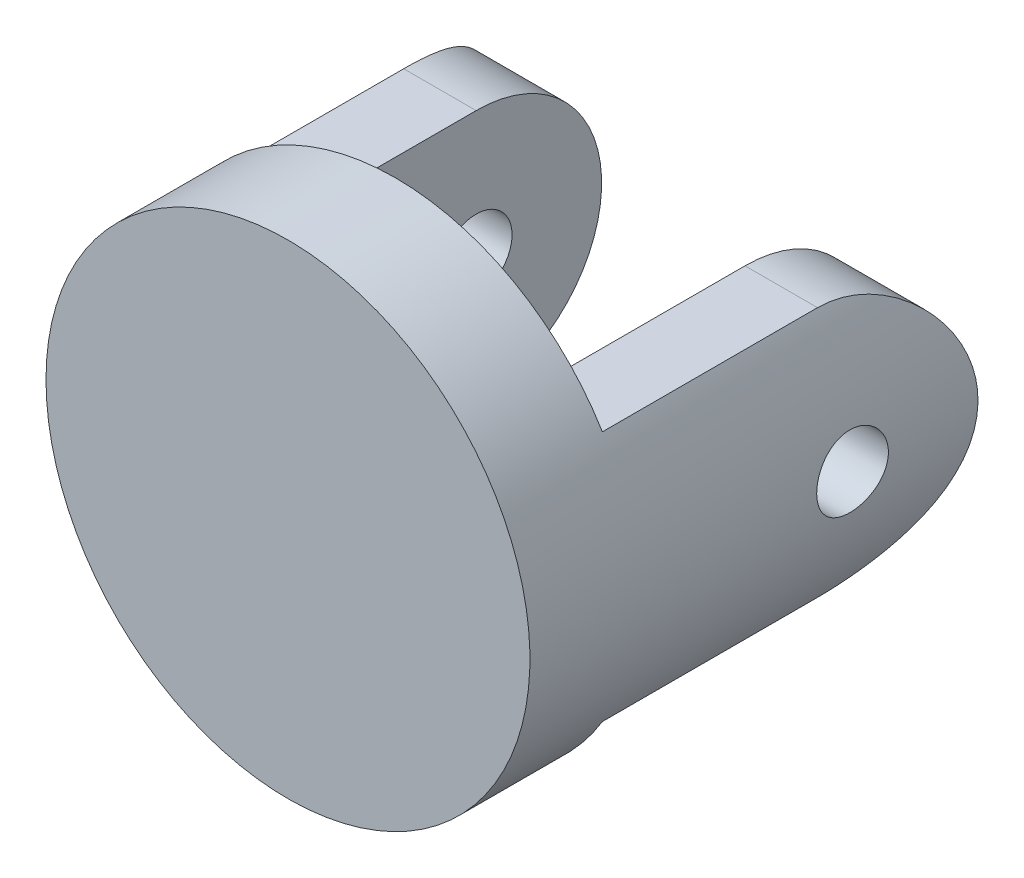
ISO-10303-21;
HEADER;
FILE_DESCRIPTION(('STEP AP214'),'2;1');
FILE_NAME('part.step','',(''),(''),'','','');
FILE_SCHEMA(('AUTOMOTIVE_DESIGN { 1 0 10303 214 1 1 1 1 }'));
ENDSEC;
DATA;
#1=APPLICATION_CONTEXT('core data for automotive mechanical design processes');
#2=APPLICATION_PROTOCOL_DEFINITION('international standard','automotive_design',2000,#1);
#3=PRODUCT_CONTEXT('',#1,'mechanical');
#4=PRODUCT('Part','Part','',(#3));
#5=PRODUCT_RELATED_PRODUCT_CATEGORY('part','',(#4));
#6=PRODUCT_DEFINITION_FORMATION('','',#4);
#7=PRODUCT_DEFINITION_CONTEXT('part definition',#1,'design');
#8=PRODUCT_DEFINITION('design','',#6,#7);
#9=PRODUCT_DEFINITION_SHAPE('','',#8);
#10=(LENGTH_UNIT() NAMED_UNIT(*) SI_UNIT(.MILLI.,.METRE.));
#11=(NAMED_UNIT(*) PLANE_ANGLE_UNIT() SI_UNIT($,.RADIAN.));
#12=(NAMED_UNIT(*) SI_UNIT($,.STERADIAN.) SOLID_ANGLE_UNIT());
#13=UNCERTAINTY_MEASURE_WITH_UNIT(LENGTH_MEASURE(1.E-05),#10,'distance_accuracy_value','');
#14=(GEOMETRIC_REPRESENTATION_CONTEXT(3) GLOBAL_UNCERTAINTY_ASSIGNED_CONTEXT((#13)) GLOBAL_UNIT_ASSIGNED_CONTEXT((#10,
#11,#12)) REPRESENTATION_CONTEXT('',''));
#15=CARTESIAN_POINT('',(0.,0.,0.));
#16=DIRECTION('',(0.,0.,1.));
#17=DIRECTION('',(1.,0.,0.));
#18=AXIS2_PLACEMENT_3D('',#15,#16,#17);
#19=CARTESIAN_POINT('',(0.,0.,-3.));
#20=DIRECTION('',(0.,0.,1.));
#21=DIRECTION('',(1.,0.,0.));
#22=AXIS2_PLACEMENT_3D('',#19,#20,#21);
#23=CYLINDRICAL_SURFACE('',#22,6.75);
#24=CARTESIAN_POINT('',(-6.75,0.,-10.));
#25=CARTESIAN_POINT('',(-6.74999911272059,0.0558425409101663,-9.99999769097387));
#26=CARTESIAN_POINT('',(-6.74929975767196,0.11171768484445,-9.99530662620021));
#27=CARTESIAN_POINT('',(-6.74657719642042,0.221906738606192,-9.97667074513461));
#28=CARTESIAN_POINT('',(-6.74455269374564,0.276219065053059,-9.96271686628341));
#29=CARTESIAN_POINT('',(-6.73940739080019,0.381671836837066,-9.92598098260033));
#30=CARTESIAN_POINT('',(-6.73628741208205,0.432814625447512,-9.90320559214683));
#31=CARTESIAN_POINT('',(-6.72929609307386,0.530544531243025,-9.84948922871422));
#32=CARTESIAN_POINT('',(-6.72542485910577,0.577132291680523,-9.81854941098927));
#33=CARTESIAN_POINT('',(-6.71732864075089,0.664793017751611,-9.7491309350935));
#34=CARTESIAN_POINT('',(-6.71310142384377,0.705826205517573,-9.7106023010483));
#35=CARTESIAN_POINT('',(-6.70478718892022,0.780869855713782,-9.62720740946487));
#36=CARTESIAN_POINT('',(-6.70070017890102,0.81487991810721,-9.58234079116041));
#37=CARTESIAN_POINT('',(-6.69310742202681,0.875066235908764,-9.48727692835771));
#38=CARTESIAN_POINT('',(-6.6896045599627,0.901204098047282,-9.43705512613478));
#39=CARTESIAN_POINT('',(-6.68360711396162,0.944658716040232,-9.33287374825251));
#40=CARTESIAN_POINT('',(-6.68111247643255,0.961975940767681,-9.27891437144231));
#41=CARTESIAN_POINT('',(-6.67743583632494,0.987174376659307,-9.16920749903019));
#42=CARTESIAN_POINT('',(-6.67624437438597,0.995123620308465,-9.11347595250868));
#43=CARTESIAN_POINT('',(-6.67528025275461,1.0015711832689,-9.00145820866673));
#44=CARTESIAN_POINT('',(-6.67550751356993,1.00007003209414,-8.94517204259854));
#45=CARTESIAN_POINT('',(-6.67734650914669,0.98771503469444,-8.83412288677399));
#46=CARTESIAN_POINT('',(-6.67894703709383,0.976936892914969,-8.77935126207585));
#47=CARTESIAN_POINT('',(-6.68333472365175,0.946452342629808,-8.67240258097881));
#48=CARTESIAN_POINT('',(-6.68612191507621,0.926745687231396,-8.62022559637161));
#49=CARTESIAN_POINT('',(-6.69258128775432,0.878884561850785,-8.51971658561811));
#50=CARTESIAN_POINT('',(-6.69625682457254,0.850697959155643,-8.47140008514764));
#51=CARTESIAN_POINT('',(-6.70407630948204,0.786699945498341,-8.38015396406128));
#52=CARTESIAN_POINT('',(-6.70822028756469,0.750888046206287,-8.33722468872742));
#53=CARTESIAN_POINT('',(-6.71655927335414,0.672240133725876,-8.2575328147743));
#54=CARTESIAN_POINT('',(-6.7207543845646,0.629339018930789,-8.22083444531941));
#55=CARTESIAN_POINT('',(-6.72868539581363,0.53795254497229,-8.15514880450797));
#56=CARTESIAN_POINT('',(-6.73242129392949,0.489467162429428,-8.12616156543701));
#57=CARTESIAN_POINT('',(-6.73901671048289,0.388233293631781,-8.07671798502691));
#58=CARTESIAN_POINT('',(-6.74187572726903,0.335482388854872,-8.05626652448112));
#59=CARTESIAN_POINT('',(-6.74639102909035,0.227243041616981,-8.02453049251672));
#60=CARTESIAN_POINT('',(-6.74804739342113,0.171754779898363,-8.01324531672315));
#61=CARTESIAN_POINT('',(-6.74996027662796,0.0601702510974134,-8.00024743323401));
#62=CARTESIAN_POINT('',(-6.75022971002842,0.00408448467763339,-7.99844640941821));
#63=CARTESIAN_POINT('',(-6.74937350522533,-0.107588256207567,-8.0042336439311));
#64=CARTESIAN_POINT('',(-6.74824790911938,-0.163175245673516,-8.01182161892944));
#65=CARTESIAN_POINT('',(-6.74473610882736,-0.272005564748215,-8.03609802204365));
#66=CARTESIAN_POINT('',(-6.74235585630278,-0.32525868441956,-8.05274349642072));
#67=CARTESIAN_POINT('',(-6.736600801366,-0.428218204093146,-8.09461714889859));
#68=CARTESIAN_POINT('',(-6.73322595324427,-0.47792444095768,-8.11984572146875));
#69=CARTESIAN_POINT('',(-6.72582473545489,-0.572768052310923,-8.17837713660647));
#70=CARTESIAN_POINT('',(-6.72179390576589,-0.617870444216265,-8.21173609025629));
#71=CARTESIAN_POINT('',(-6.71354345616816,-0.70186815594721,-8.28550310799369));
#72=CARTESIAN_POINT('',(-6.70932382558081,-0.740763124109861,-8.32591157117883));
#73=CARTESIAN_POINT('',(-6.70113048938946,-0.811562616638169,-8.41302340493409));
#74=CARTESIAN_POINT('',(-6.69715905164284,-0.843407990393644,-8.45977509537694));
#75=CARTESIAN_POINT('',(-6.68995170503097,-0.898793373321401,-8.55801596133042));
#76=CARTESIAN_POINT('',(-6.68671577667948,-0.922333602535497,-8.60950501128083));
#77=CARTESIAN_POINT('',(-6.68136217784517,-0.960348470530136,-8.71558147446953));
#78=CARTESIAN_POINT('',(-6.67924064990097,-0.974854414016819,-8.77015746572115));
#79=CARTESIAN_POINT('',(-6.67634573947977,-0.994488675177338,-8.88100475377632));
#80=CARTESIAN_POINT('',(-6.67557226638415,-0.999617623190394,-8.93727593636741));
#81=CARTESIAN_POINT('',(-6.67546436730878,-1.00033757943703,-9.04932679953471));
#82=CARTESIAN_POINT('',(-6.67611591022978,-0.996021584936614,-9.1051058913773));
#83=CARTESIAN_POINT('',(-6.67875416313144,-0.978173271070794,-9.21513569011213));
#84=CARTESIAN_POINT('',(-6.68074087117957,-0.964640965045213,-9.26938639921645));
#85=CARTESIAN_POINT('',(-6.6858207421393,-0.928776749344401,-9.37479475543769));
#86=CARTESIAN_POINT('',(-6.68891310765919,-0.906451180127705,-9.42595460065922));
#87=CARTESIAN_POINT('',(-6.69585685750153,-0.853643415012498,-9.52381748578127));
#88=CARTESIAN_POINT('',(-6.69970826624953,-0.823160956618996,-9.57052038218812));
#89=CARTESIAN_POINT('',(-6.70778131838235,-0.75456623134579,-9.65861638512301));
#90=CARTESIAN_POINT('',(-6.7120060970762,-0.716385046344521,-9.69995554821063));
#91=CARTESIAN_POINT('',(-6.72032356595988,-0.633622295064075,-9.77567319173752));
#92=CARTESIAN_POINT('',(-6.72441622518943,-0.589039241744765,-9.810050050473));
#93=CARTESIAN_POINT('',(-6.73203333976492,-0.49445748182144,-9.87103143181466));
#94=CARTESIAN_POINT('',(-6.73555463068598,-0.444431017911155,-9.89759329015296));
#95=CARTESIAN_POINT('',(-6.74160116950649,-0.340598638239509,-9.94189806599035));
#96=CARTESIAN_POINT('',(-6.74412745252673,-0.286796719176187,-9.9596501534456));
#97=CARTESIAN_POINT('',(-6.7473200627825,-0.193958660761499,-9.9817862974269));
#98=CARTESIAN_POINT('',(-6.74831989929762,-0.155496645397277,-9.98860604809085));
#99=CARTESIAN_POINT('',(-6.74966017396957,-0.0780283890929515,-9.99771367900938));
#100=CARTESIAN_POINT('',(-6.75000062002111,-0.0390221546742599,-10.0000016135221));
#101=CARTESIAN_POINT('',(-6.75,0.,-10.));
#102=B_SPLINE_CURVE_WITH_KNOTS('',3,(#24,#25,#26,#27,#28,#29,#30,#31,#32,#33,#34,#35,#36,#37,
#38,#39,#40,#41,#42,#43,#44,#45,#46,#47,#48,#49,#50,#51,#52,#53,#54,#55,#56,#57,#58,#59,#60,#61,
#62,#63,#64,#65,#66,#67,#68,#69,#70,#71,#72,#73,#74,#75,#76,#77,#78,#79,#80,#81,#82,#83,#84,#85,
#86,#87,#88,#89,#90,#91,#92,#93,#94,#95,#96,#97,#98,#99,#100,#101),.UNSPECIFIED.,.T.,.F.,(4,2,2,
2,2,2,2,2,2,2,2,2,2,2,2,2,2,2,2,2,2,2,2,2,2,2,2,2,2,2,2,2,2,2,2,2,2,2,4),(0.,0.167385036095002,
0.33493408033917,0.502357738579205,0.669757719315228,0.838299369512644,1.00685061718639,
1.17621106378314,1.34556250685453,1.51367634882374,1.68178077130973,1.84852625275946,
2.01527634536397,2.18266643054019,2.35006723873285,2.51910075696945,2.6881349829183,
2.85726573135219,3.02638532731912,3.19392726588316,3.36146414868354,3.52821335257178,
3.69497022109769,3.86291226368386,4.03086381714738,4.20017525181088,4.36948220029192,
4.53819917064466,4.70690479910917,4.87395678992067,5.04100853893917,5.20794005372038,
5.37487694113277,5.54338046523498,5.71192319321397,5.88136966036332,6.05063938138702,
6.16760760787006,6.28457443391695),.UNSPECIFIED.);
#103=CARTESIAN_POINT('',(-6.75,0.,-10.));
#104=VERTEX_POINT('',#103);
#105=EDGE_CURVE('E257',#104,#104,#102,.T.);
#106=ORIENTED_EDGE('',*,*,#105,.T.);
#107=EDGE_LOOP('',(#106));
#108=FACE_BOUND('',#107,.T.);
#109=CARTESIAN_POINT('',(6.75,0.,-10.));
#110=CARTESIAN_POINT('',(6.74999911272059,-0.0558425409101663,-9.99999769097387));
#111=CARTESIAN_POINT('',(6.74929975767196,-0.11171768484445,-9.99530662620021));
#112=CARTESIAN_POINT('',(6.74657719642042,-0.221906738606192,-9.97667074513461));
#113=CARTESIAN_POINT('',(6.74455269374564,-0.276219065053059,-9.96271686628341));
#114=CARTESIAN_POINT('',(6.73940739080019,-0.381671836837066,-9.92598098260033));
#115=CARTESIAN_POINT('',(6.73628741208205,-0.432814625447512,-9.90320559214683));
#116=CARTESIAN_POINT('',(6.72929609307386,-0.530544531243025,-9.84948922871422));
#117=CARTESIAN_POINT('',(6.72542485910577,-0.577132291680523,-9.81854941098927));
#118=CARTESIAN_POINT('',(6.71732864075089,-0.664793017751611,-9.7491309350935));
#119=CARTESIAN_POINT('',(6.71310142384377,-0.705826205517573,-9.7106023010483));
#120=CARTESIAN_POINT('',(6.70478718892022,-0.780869855713782,-9.62720740946487));
#121=CARTESIAN_POINT('',(6.70070017890102,-0.81487991810721,-9.58234079116041));
#122=CARTESIAN_POINT('',(6.69310742202681,-0.875066235908764,-9.48727692835771));
#123=CARTESIAN_POINT('',(6.6896045599627,-0.901204098047282,-9.43705512613478));
#124=CARTESIAN_POINT('',(6.68360711396162,-0.944658716040232,-9.33287374825251));
#125=CARTESIAN_POINT('',(6.68111247643255,-0.961975940767681,-9.27891437144231));
#126=CARTESIAN_POINT('',(6.67743583632494,-0.987174376659307,-9.16920749903019));
#127=CARTESIAN_POINT('',(6.67624437438597,-0.995123620308465,-9.11347595250868));
#128=CARTESIAN_POINT('',(6.67528025275461,-1.0015711832689,-9.00145820866673));
#129=CARTESIAN_POINT('',(6.67550751356993,-1.00007003209414,-8.94517204259854));
#130=CARTESIAN_POINT('',(6.67734650914669,-0.98771503469444,-8.83412288677399));
#131=CARTESIAN_POINT('',(6.67894703709383,-0.976936892914969,-8.77935126207585));
#132=CARTESIAN_POINT('',(6.68333472365175,-0.946452342629808,-8.67240258097881));
#133=CARTESIAN_POINT('',(6.68612191507621,-0.926745687231396,-8.62022559637161));
#134=CARTESIAN_POINT('',(6.69258128775432,-0.878884561850785,-8.51971658561811));
#135=CARTESIAN_POINT('',(6.69625682457254,-0.850697959155643,-8.47140008514764));
#136=CARTESIAN_POINT('',(6.70407630948204,-0.786699945498341,-8.38015396406128));
#137=CARTESIAN_POINT('',(6.70822028756469,-0.750888046206287,-8.33722468872742));
#138=CARTESIAN_POINT('',(6.71655927335414,-0.672240133725876,-8.2575328147743));
#139=CARTESIAN_POINT('',(6.7207543845646,-0.629339018930789,-8.22083444531941));
#140=CARTESIAN_POINT('',(6.72868539581363,-0.53795254497229,-8.15514880450797));
#141=CARTESIAN_POINT('',(6.73242129392949,-0.489467162429428,-8.12616156543701));
#142=CARTESIAN_POINT('',(6.73901671048289,-0.388233293631781,-8.07671798502691));
#143=CARTESIAN_POINT('',(6.74187572726903,-0.335482388854872,-8.05626652448112));
#144=CARTESIAN_POINT('',(6.74639102909035,-0.227243041616981,-8.02453049251672));
#145=CARTESIAN_POINT('',(6.74804739342113,-0.171754779898363,-8.01324531672315));
#146=CARTESIAN_POINT('',(6.74996027662796,-0.0601702510974134,-8.00024743323401));
#147=CARTESIAN_POINT('',(6.75022971002842,-0.00408448467763339,-7.99844640941821));
#148=CARTESIAN_POINT('',(6.74937350522533,0.107588256207567,-8.0042336439311));
#149=CARTESIAN_POINT('',(6.74824790911938,0.163175245673516,-8.01182161892944));
#150=CARTESIAN_POINT('',(6.74473610882736,0.272005564748215,-8.03609802204365));
#151=CARTESIAN_POINT('',(6.74235585630278,0.32525868441956,-8.05274349642072));
#152=CARTESIAN_POINT('',(6.736600801366,0.428218204093146,-8.09461714889859));
#153=CARTESIAN_POINT('',(6.73322595324427,0.47792444095768,-8.11984572146875));
#154=CARTESIAN_POINT('',(6.72582473545489,0.572768052310923,-8.17837713660647));
#155=CARTESIAN_POINT('',(6.72179390576589,0.617870444216265,-8.21173609025629));
#156=CARTESIAN_POINT('',(6.71354345616816,0.70186815594721,-8.28550310799369));
#157=CARTESIAN_POINT('',(6.70932382558081,0.740763124109861,-8.32591157117883));
#158=CARTESIAN_POINT('',(6.70113048938946,0.811562616638169,-8.41302340493409));
#159=CARTESIAN_POINT('',(6.69715905164284,0.843407990393644,-8.45977509537694));
#160=CARTESIAN_POINT('',(6.68995170503097,0.898793373321401,-8.55801596133042));
#161=CARTESIAN_POINT('',(6.68671577667948,0.922333602535497,-8.60950501128083));
#162=CARTESIAN_POINT('',(6.68136217784517,0.960348470530136,-8.71558147446953));
#163=CARTESIAN_POINT('',(6.67924064990097,0.974854414016819,-8.77015746572115));
#164=CARTESIAN_POINT('',(6.67634573947977,0.994488675177338,-8.88100475377632));
#165=CARTESIAN_POINT('',(6.67557226638415,0.999617623190394,-8.93727593636741));
#166=CARTESIAN_POINT('',(6.67546436730878,1.00033757943703,-9.04932679953471));
#167=CARTESIAN_POINT('',(6.67611591022978,0.996021584936614,-9.1051058913773));
#168=CARTESIAN_POINT('',(6.67875416313144,0.978173271070794,-9.21513569011213));
#169=CARTESIAN_POINT('',(6.68074087117957,0.964640965045213,-9.26938639921645));
#170=CARTESIAN_POINT('',(6.6858207421393,0.928776749344401,-9.37479475543769));
#171=CARTESIAN_POINT('',(6.68891310765919,0.906451180127705,-9.42595460065922));
#172=CARTESIAN_POINT('',(6.69585685750153,0.853643415012498,-9.52381748578127));
#173=CARTESIAN_POINT('',(6.69970826624953,0.823160956618996,-9.57052038218812));
#174=CARTESIAN_POINT('',(6.70778131838235,0.75456623134579,-9.65861638512301));
#175=CARTESIAN_POINT('',(6.7120060970762,0.716385046344521,-9.69995554821063));
#176=CARTESIAN_POINT('',(6.72032356595988,0.633622295064075,-9.77567319173752));
#177=CARTESIAN_POINT('',(6.72441622518943,0.589039241744765,-9.810050050473));
#178=CARTESIAN_POINT('',(6.73203333976492,0.49445748182144,-9.87103143181466));
#179=CARTESIAN_POINT('',(6.73555463068598,0.444431017911155,-9.89759329015296));
#180=CARTESIAN_POINT('',(6.74160116950649,0.340598638239509,-9.94189806599035));
#181=CARTESIAN_POINT('',(6.74412745252673,0.286796719176187,-9.9596501534456));
#182=CARTESIAN_POINT('',(6.7473200627825,0.193958660761499,-9.9817862974269));
#183=CARTESIAN_POINT('',(6.74831989929762,0.155496645397277,-9.98860604809085));
#184=CARTESIAN_POINT('',(6.74966017396957,0.0780283890929515,-9.99771367900938));
#185=CARTESIAN_POINT('',(6.75000062002111,0.0390221546742599,-10.0000016135221));
#186=CARTESIAN_POINT('',(6.75,0.,-10.));
#187=B_SPLINE_CURVE_WITH_KNOTS('',3,(#109,#110,#111,#112,#113,#114,#115,#116,#117,#118,#119,
#120,#121,#122,#123,#124,#125,#126,#127,#128,#129,#130,#131,#132,#133,#134,#135,#136,#137,#138,
#139,#140,#141,#142,#143,#144,#145,#146,#147,#148,#149,#150,#151,#152,#153,#154,#155,#156,#157,
#158,#159,#160,#161,#162,#163,#164,#165,#166,#167,#168,#169,#170,#171,#172,#173,#174,#175,#176,
#177,#178,#179,#180,#181,#182,#183,#184,#185,#186),.UNSPECIFIED.,.T.,.F.,(4,2,2,2,2,2,2,2,2,2,2,
2,2,2,2,2,2,2,2,2,2,2,2,2,2,2,2,2,2,2,2,2,2,2,2,2,2,2,4),(0.,0.167385036095002,0.33493408033917,
0.502357738579205,0.669757719315228,0.838299369512644,1.00685061718639,1.17621106378314,
1.34556250685453,1.51367634882374,1.68178077130973,1.84852625275946,2.01527634536397,
2.18266643054019,2.35006723873285,2.51910075696945,2.6881349829183,2.85726573135219,
3.02638532731912,3.19392726588316,3.36146414868354,3.52821335257178,3.69497022109769,
3.86291226368386,4.03086381714738,4.20017525181088,4.36948220029192,4.53819917064466,
4.70690479910917,4.87395678992067,5.04100853893917,5.20794005372038,5.37487694113277,
5.54338046523498,5.71192319321397,5.88136966036332,6.05063938138702,6.16760760787006,
6.28457443391695),.UNSPECIFIED.);
#188=CARTESIAN_POINT('',(6.75,0.,-10.));
#189=VERTEX_POINT('',#188);
#190=EDGE_CURVE('E260',#189,#189,#187,.T.);
#191=ORIENTED_EDGE('',*,*,#190,.T.);
#192=EDGE_LOOP('',(#191));
#193=FACE_BOUND('',#192,.T.);
#194=CARTESIAN_POINT('',(0.,0.,0.));
#195=DIRECTION('',(0.,0.,-1.));
#196=DIRECTION('',(-1.,0.,0.));
#197=AXIS2_PLACEMENT_3D('',#194,#195,#196);
#198=CIRCLE('',#197,6.75);
#199=CARTESIAN_POINT('',(-6.75,0.,0.));
#200=VERTEX_POINT('',#199);
#201=EDGE_CURVE('E188',#200,#200,#198,.T.);
#202=ORIENTED_EDGE('',*,*,#201,.T.);
#203=EDGE_LOOP('',(#202));
#204=FACE_BOUND('',#203,.T.);
#205=DIRECTION('',(0.,0.,1.));
#206=VECTOR('',#205,1.);
#207=CARTESIAN_POINT('',(5.7716981903076,-3.5,-12.5));
#208=LINE('',#207,#206);
#209=CARTESIAN_POINT('',(5.7716981903076,-3.5,-9.));
#210=VERTEX_POINT('',#209);
#211=CARTESIAN_POINT('',(5.7716981903076,-3.5,-3.));
#212=VERTEX_POINT('',#211);
#213=EDGE_CURVE('E187',#210,#212,#208,.T.);
#214=ORIENTED_EDGE('',*,*,#213,.F.);
#215=CARTESIAN_POINT('',(5.7716981903076,3.5,-9.));
#216=CARTESIAN_POINT('',(5.77166955421002,3.50001705554504,-9.09112967203056));
#217=CARTESIAN_POINT('',(5.77385573039002,3.49644148706506,-9.18224330636654));
#218=CARTESIAN_POINT('',(5.78244171296421,3.48223957213489,-9.36366027495266));
#219=CARTESIAN_POINT('',(5.78883869884604,3.47161794528503,-9.4539641106151));
#220=CARTESIAN_POINT('',(5.8055794457996,3.44354424311248,-9.63255884534527));
#221=CARTESIAN_POINT('',(5.81589880800477,3.42613437661979,-9.7208586824379));
#222=CARTESIAN_POINT('',(5.8400971794397,3.38472148424651,-9.89538463003258));
#223=CARTESIAN_POINT('',(5.85397664340042,3.36071761608778,-9.98161047408396));
#224=CARTESIAN_POINT('',(5.90020187745128,3.27933331417957,-10.235939769041));
#225=CARTESIAN_POINT('',(5.93719387256824,3.21248677463199,-10.4002758228421));
#226=CARTESIAN_POINT('',(6.01931780913164,3.05583264232749,-10.7155181456973));
#227=CARTESIAN_POINT('',(6.06446323301233,2.96598691404088,-10.8664015428341));
#228=CARTESIAN_POINT('',(6.16264056776468,2.75660193180785,-11.1650012631881));
#229=CARTESIAN_POINT('',(6.21601685999561,2.63514101237681,-11.3112609853852));
#230=CARTESIAN_POINT('',(6.32186227552666,2.37001501026079,-11.5824506155107));
#231=CARTESIAN_POINT('',(6.37433103978394,2.22634135335382,-11.7073722474757));
#232=CARTESIAN_POINT('',(6.47713032509302,1.90767178791382,-11.9415319664244));
#233=CARTESIAN_POINT('',(6.52701273178548,1.73114219734409,-12.0489165521625));
#234=CARTESIAN_POINT('',(6.59252243494399,1.45268714248443,-12.1859746896809));
#235=CARTESIAN_POINT('',(6.61280630524951,1.35759448846738,-12.2276568912017));
#236=CARTESIAN_POINT('',(6.64970570263882,1.16347180275601,-12.3025976795009));
#237=CARTESIAN_POINT('',(6.66632220054168,1.06444282128917,-12.3358584959144));
#238=CARTESIAN_POINT('',(6.70325793796902,0.808346178347382,-12.4092047876708));
#239=CARTESIAN_POINT('',(6.72066792574392,0.649032894259845,-12.4431472978045));
#240=CARTESIAN_POINT('',(6.74403968155987,0.326492109055726,-12.4885444837744));
#241=CARTESIAN_POINT('',(6.75000510269833,0.163265873799953,-12.5000063354468));
#242=CARTESIAN_POINT('',(6.74999426917082,-0.183363540953696,-12.4999928846737));
#243=CARTESIAN_POINT('',(6.74245762627459,-0.366777079930822,-12.4855203872262));
#244=CARTESIAN_POINT('',(6.71307969249925,-0.727990267216297,-12.4283413782658));
#245=CARTESIAN_POINT('',(6.6912304660912,-0.905786743819562,-12.3856192037591));
#246=CARTESIAN_POINT('',(6.63549697804145,-1.2502132149756,-12.2740853297312));
#247=CARTESIAN_POINT('',(6.60165505000524,-1.41688006807026,-12.2053653441941));
#248=CARTESIAN_POINT('',(6.52498977679903,-1.73608609268259,-12.0443390011145));
#249=CARTESIAN_POINT('',(6.482164616279,-1.88862239967496,-11.9520278754017));
#250=CARTESIAN_POINT('',(6.38822453662088,-2.18607698720936,-11.739804038613));
#251=CARTESIAN_POINT('',(6.33675608268062,-2.32989818981952,-11.6185118676454));
#252=CARTESIAN_POINT('',(6.23239813645147,-2.59619176957678,-11.3547805876641));
#253=CARTESIAN_POINT('',(6.17950732609221,-2.7186434979309,-11.2123212687008));
#254=CARTESIAN_POINT('',(6.07301991608375,-2.94930903512128,-10.8955441184375));
#255=CARTESIAN_POINT('',(6.01975168260832,-3.05540163910414,-10.7195419513625));
#256=CARTESIAN_POINT('',(5.94847215092401,-3.19073390424003,-10.4421572873763));
#257=CARTESIAN_POINT('',(5.92615721445445,-3.23186426667083,-10.3475092158008));
#258=CARTESIAN_POINT('',(5.88523085987807,-3.305804412711,-10.1542678064187));
#259=CARTESIAN_POINT('',(5.86661687095029,-3.33861997647864,-10.0556772647871));
#260=CARTESIAN_POINT('',(5.83770575121213,-3.38885286422883,-9.87866897731385));
#261=CARTESIAN_POINT('',(5.82648140039545,-3.40807647409248,-9.80090857321224));
#262=CARTESIAN_POINT('',(5.80698300904305,-3.44119398640323,-9.64390773356597));
#263=CARTESIAN_POINT('',(5.7987082133648,-3.45508925307723,-9.56466768231447));
#264=CARTESIAN_POINT('',(5.7853283424933,-3.47744975957481,-9.40481821512416));
#265=CARTESIAN_POINT('',(5.78023664157441,-3.48589209290093,-9.32420446406578));
#266=CARTESIAN_POINT('',(5.77341130360068,-3.49717450838588,-9.16239688187655));
#267=CARTESIAN_POINT('',(5.77167969418554,-3.50001120785646,-9.0812027301436));
#268=CARTESIAN_POINT('',(5.7716981903076,-3.5,-9.));
#269=B_SPLINE_CURVE_WITH_KNOTS('',3,(#215,#216,#217,#218,#219,#220,#221,#222,#223,#224,#225,
#226,#227,#228,#229,#230,#231,#232,#233,#234,#235,#236,#237,#238,#239,#240,#241,#242,#243,#244,
#245,#246,#247,#248,#249,#250,#251,#252,#253,#254,#255,#256,#257,#258,#259,#260,#261,#262,#263,
#264,#265,#266,#267,#268),.UNSPECIFIED.,.F.,.F.,(4,2,2,2,2,2,2,2,2,2,2,2,2,2,2,2,2,2,2,2,2,2,2,
2,2,2,4),(0.,0.273266457469641,0.546350059803084,0.81776205077936,1.08920872642422,
1.63035056553494,2.17239556411608,2.76231271942996,3.35245815672481,3.98642701695891,
4.30339604861506,4.62028107199127,5.10968645463685,5.59893559342907,6.14841021668935,
6.69818975112102,7.24604761353161,7.7940162950224,8.37674582580403,8.96003535292281,
9.59334043484273,9.90972008307293,10.2258791880275,10.4683092152784,10.7106771311512,
10.9540566679023,11.1975830258738),.UNSPECIFIED.);
#270=CARTESIAN_POINT('',(5.7716981903076,3.5,-9.));
#271=VERTEX_POINT('',#270);
#272=EDGE_CURVE('E152',#271,#210,#269,.T.);
#273=ORIENTED_EDGE('',*,*,#272,.F.);
#274=DIRECTION('',(0.,0.,1.));
#275=VECTOR('',#274,1.);
#276=CARTESIAN_POINT('',(5.7716981903076,3.5,-12.5));
#277=LINE('',#276,#275);
#278=CARTESIAN_POINT('',(5.7716981903076,3.5,-3.));
#279=VERTEX_POINT('',#278);
#280=EDGE_CURVE('E182',#271,#279,#277,.T.);
#281=ORIENTED_EDGE('',*,*,#280,.T.);
#282=CARTESIAN_POINT('',(0.,0.,-3.));
#283=DIRECTION('',(0.,0.,-1.));
#284=DIRECTION('',(-1.,0.,0.));
#285=AXIS2_PLACEMENT_3D('',#282,#283,#284);
#286=CIRCLE('',#285,6.75);
#287=CARTESIAN_POINT('',(-5.7716981903076,3.5,-3.));
#288=VERTEX_POINT('',#287);
#289=EDGE_CURVE('E81',#288,#279,#286,.T.);
#290=ORIENTED_EDGE('',*,*,#289,.F.);
#291=DIRECTION('',(0.,0.,1.));
#292=VECTOR('',#291,1.);
#293=CARTESIAN_POINT('',(-5.7716981903076,3.5,-12.5));
#294=LINE('',#293,#292);
#295=CARTESIAN_POINT('',(-5.7716981903076,3.5,-9.));
#296=VERTEX_POINT('',#295);
#297=EDGE_CURVE('E149',#296,#288,#294,.T.);
#298=ORIENTED_EDGE('',*,*,#297,.F.);
#299=CARTESIAN_POINT('',(-5.7716981903076,-3.5,-9.));
#300=CARTESIAN_POINT('',(-5.77166955421002,-3.50001705554504,-9.09112967203056));
#301=CARTESIAN_POINT('',(-5.77385573039002,-3.49644148706506,-9.18224330636654));
#302=CARTESIAN_POINT('',(-5.78244171296421,-3.48223957213489,-9.36366027495266));
#303=CARTESIAN_POINT('',(-5.78883869884604,-3.47161794528503,-9.4539641106151));
#304=CARTESIAN_POINT('',(-5.8055794457996,-3.44354424311248,-9.63255884534527));
#305=CARTESIAN_POINT('',(-5.81589880800477,-3.42613437661979,-9.7208586824379));
#306=CARTESIAN_POINT('',(-5.8400971794397,-3.38472148424651,-9.89538463003258));
#307=CARTESIAN_POINT('',(-5.85397664340042,-3.36071761608778,-9.98161047408396));
#308=CARTESIAN_POINT('',(-5.90020187745128,-3.27933331417957,-10.235939769041));
#309=CARTESIAN_POINT('',(-5.93719387256824,-3.21248677463199,-10.4002758228421));
#310=CARTESIAN_POINT('',(-6.01931780913164,-3.05583264232749,-10.7155181456973));
#311=CARTESIAN_POINT('',(-6.06446323301233,-2.96598691404088,-10.8664015428341));
#312=CARTESIAN_POINT('',(-6.16264056776468,-2.75660193180785,-11.1650012631881));
#313=CARTESIAN_POINT('',(-6.21601685999561,-2.63514101237681,-11.3112609853852));
#314=CARTESIAN_POINT('',(-6.32186227552666,-2.37001501026079,-11.5824506155107));
#315=CARTESIAN_POINT('',(-6.37433103978394,-2.22634135335382,-11.7073722474757));
#316=CARTESIAN_POINT('',(-6.47713032509302,-1.90767178791382,-11.9415319664244));
#317=CARTESIAN_POINT('',(-6.52701273178548,-1.73114219734409,-12.0489165521625));
#318=CARTESIAN_POINT('',(-6.59252243494399,-1.45268714248443,-12.1859746896809));
#319=CARTESIAN_POINT('',(-6.61280630524951,-1.35759448846738,-12.2276568912017));
#320=CARTESIAN_POINT('',(-6.64970570263882,-1.16347180275601,-12.3025976795009));
#321=CARTESIAN_POINT('',(-6.66632220054168,-1.06444282128917,-12.3358584959144));
#322=CARTESIAN_POINT('',(-6.70325793796902,-0.808346178347382,-12.4092047876708));
#323=CARTESIAN_POINT('',(-6.72066792574392,-0.649032894259845,-12.4431472978045));
#324=CARTESIAN_POINT('',(-6.74403968155987,-0.326492109055726,-12.4885444837744));
#325=CARTESIAN_POINT('',(-6.75000510269833,-0.163265873799953,-12.5000063354468));
#326=CARTESIAN_POINT('',(-6.74999426917082,0.183363540953696,-12.4999928846737));
#327=CARTESIAN_POINT('',(-6.74245762627459,0.366777079930822,-12.4855203872262));
#328=CARTESIAN_POINT('',(-6.71307969249925,0.727990267216297,-12.4283413782658));
#329=CARTESIAN_POINT('',(-6.6912304660912,0.905786743819562,-12.3856192037591));
#330=CARTESIAN_POINT('',(-6.63549697804145,1.2502132149756,-12.2740853297312));
#331=CARTESIAN_POINT('',(-6.60165505000524,1.41688006807026,-12.2053653441941));
#332=CARTESIAN_POINT('',(-6.52498977679903,1.73608609268259,-12.0443390011145));
#333=CARTESIAN_POINT('',(-6.482164616279,1.88862239967496,-11.9520278754017));
#334=CARTESIAN_POINT('',(-6.38822453662088,2.18607698720936,-11.739804038613));
#335=CARTESIAN_POINT('',(-6.33675608268062,2.32989818981952,-11.6185118676454));
#336=CARTESIAN_POINT('',(-6.23239813645147,2.59619176957678,-11.3547805876641));
#337=CARTESIAN_POINT('',(-6.17950732609221,2.7186434979309,-11.2123212687008));
#338=CARTESIAN_POINT('',(-6.07301991608375,2.94930903512128,-10.8955441184375));
#339=CARTESIAN_POINT('',(-6.01975168260832,3.05540163910414,-10.7195419513625));
#340=CARTESIAN_POINT('',(-5.94847215092401,3.19073390424003,-10.4421572873763));
#341=CARTESIAN_POINT('',(-5.92615721445445,3.23186426667083,-10.3475092158008));
#342=CARTESIAN_POINT('',(-5.88523085987807,3.305804412711,-10.1542678064187));
#343=CARTESIAN_POINT('',(-5.86661687095029,3.33861997647864,-10.0556772647871));
#344=CARTESIAN_POINT('',(-5.83770575121213,3.38885286422883,-9.87866897731385));
#345=CARTESIAN_POINT('',(-5.82648140039545,3.40807647409248,-9.80090857321224));
#346=CARTESIAN_POINT('',(-5.80698300904305,3.44119398640323,-9.64390773356597));
#347=CARTESIAN_POINT('',(-5.7987082133648,3.45508925307723,-9.56466768231447));
#348=CARTESIAN_POINT('',(-5.7853283424933,3.47744975957481,-9.40481821512416));
#349=CARTESIAN_POINT('',(-5.78023664157441,3.48589209290093,-9.32420446406578));
#350=CARTESIAN_POINT('',(-5.77341130360068,3.49717450838588,-9.16239688187655));
#351=CARTESIAN_POINT('',(-5.77167969418554,3.50001120785646,-9.0812027301436));
#352=CARTESIAN_POINT('',(-5.7716981903076,3.5,-9.));
#353=B_SPLINE_CURVE_WITH_KNOTS('',3,(#299,#300,#301,#302,#303,#304,#305,#306,#307,#308,#309,
#310,#311,#312,#313,#314,#315,#316,#317,#318,#319,#320,#321,#322,#323,#324,#325,#326,#327,#328,
#329,#330,#331,#332,#333,#334,#335,#336,#337,#338,#339,#340,#341,#342,#343,#344,#345,#346,#347,
#348,#349,#350,#351,#352),.UNSPECIFIED.,.F.,.F.,(4,2,2,2,2,2,2,2,2,2,2,2,2,2,2,2,2,2,2,2,2,2,2,
2,2,2,4),(0.,0.273266457469641,0.546350059803084,0.81776205077936,1.08920872642422,
1.63035056553494,2.17239556411608,2.76231271942996,3.35245815672481,3.98642701695891,
4.30339604861506,4.62028107199127,5.10968645463685,5.59893559342907,6.14841021668935,
6.69818975112102,7.24604761353161,7.7940162950224,8.37674582580403,8.96003535292281,
9.59334043484273,9.90972008307293,10.2258791880275,10.4683092152784,10.7106771311512,
10.9540566679023,11.1975830258738),.UNSPECIFIED.);
#354=CARTESIAN_POINT('',(-5.7716981903076,-3.5,-9.));
#355=VERTEX_POINT('',#354);
#356=EDGE_CURVE('E142',#355,#296,#353,.T.);
#357=ORIENTED_EDGE('',*,*,#356,.F.);
#358=DIRECTION('',(0.,0.,1.));
#359=VECTOR('',#358,1.);
#360=CARTESIAN_POINT('',(-5.7716981903076,-3.5,-12.5));
#361=LINE('',#360,#359);
#362=CARTESIAN_POINT('',(-5.7716981903076,-3.5,-3.));
#363=VERTEX_POINT('',#362);
#364=EDGE_CURVE('E147',#355,#363,#361,.T.);
#365=ORIENTED_EDGE('',*,*,#364,.T.);
#366=EDGE_CURVE('E12',#212,#363,#286,.T.);
#367=ORIENTED_EDGE('',*,*,#366,.F.);
#368=EDGE_LOOP('',(#214,#273,#281,#290,#298,#357,#365,#367));
#369=FACE_BOUND('',#368,.T.);
#370=ADVANCED_FACE('F72',(#108,#193,#204,#369),#23,.T.);
#371=CARTESIAN_POINT('',(3.75,3.5,-12.5));
#372=DIRECTION('',(1.,0.,0.));
#373=DIRECTION('',(0.,0.,-1.));
#374=AXIS2_PLACEMENT_3D('',#371,#372,#373);
#375=PLANE('',#374);
#376=CARTESIAN_POINT('',(3.75,0.,-9.));
#377=DIRECTION('',(1.,0.,0.));
#378=DIRECTION('',(0.,0.,-1.));
#379=AXIS2_PLACEMENT_3D('',#376,#377,#378);
#380=CIRCLE('',#379,1.);
#381=CARTESIAN_POINT('',(3.75,0.,-10.));
#382=VERTEX_POINT('',#381);
#383=EDGE_CURVE('E262',#382,#382,#380,.T.);
#384=ORIENTED_EDGE('',*,*,#383,.T.);
#385=EDGE_LOOP('',(#384));
#386=FACE_BOUND('',#385,.T.);
#387=CARTESIAN_POINT('',(3.75,0.,-9.));
#388=DIRECTION('',(1.,0.,0.));
#389=DIRECTION('',(0.,0.,-1.));
#390=AXIS2_PLACEMENT_3D('',#387,#388,#389);
#391=CIRCLE('',#390,3.5);
#392=CARTESIAN_POINT('',(3.75,-3.5,-9.));
#393=VERTEX_POINT('',#392);
#394=CARTESIAN_POINT('',(3.75,3.5,-9.));
#395=VERTEX_POINT('',#394);
#396=EDGE_CURVE('E153',#393,#395,#391,.T.);
#397=ORIENTED_EDGE('',*,*,#396,.F.);
#398=DIRECTION('',(0.,0.,1.));
#399=VECTOR('',#398,1.);
#400=CARTESIAN_POINT('',(3.75,-3.5,-12.5));
#401=LINE('',#400,#399);
#402=CARTESIAN_POINT('',(3.75,-3.5,-3.));
#403=VERTEX_POINT('',#402);
#404=EDGE_CURVE('E185',#393,#403,#401,.T.);
#405=ORIENTED_EDGE('',*,*,#404,.T.);
#406=DIRECTION('',(0.,1.,0.));
#407=VECTOR('',#406,1.);
#408=CARTESIAN_POINT('',(3.75,3.5,-3.));
#409=LINE('',#408,#407);
#410=CARTESIAN_POINT('',(3.75,3.5,-3.));
#411=VERTEX_POINT('',#410);
#412=EDGE_CURVE('E177',#403,#411,#409,.T.);
#413=ORIENTED_EDGE('',*,*,#412,.T.);
#414=DIRECTION('',(0.,0.,1.));
#415=VECTOR('',#414,1.);
#416=CARTESIAN_POINT('',(3.75,3.5,-12.5));
#417=LINE('',#416,#415);
#418=EDGE_CURVE('E97',#395,#411,#417,.T.);
#419=ORIENTED_EDGE('',*,*,#418,.F.);
#420=EDGE_LOOP('',(#397,#405,#413,#419));
#421=FACE_BOUND('',#420,.T.);
#422=ADVANCED_FACE('F230',(#386,#421),#375,.F.);
#423=CARTESIAN_POINT('',(-3.75,-3.5,-12.5));
#424=DIRECTION('',(-1.,0.,0.));
#425=DIRECTION('',(0.,-1.,0.));
#426=AXIS2_PLACEMENT_3D('',#423,#424,#425);
#427=PLANE('',#426);
#428=CARTESIAN_POINT('',(-3.75,0.,-9.));
#429=DIRECTION('',(-1.,0.,0.));
#430=DIRECTION('',(0.,-1.,0.));
#431=AXIS2_PLACEMENT_3D('',#428,#429,#430);
#432=CIRCLE('',#431,1.);
#433=CARTESIAN_POINT('',(-3.75,-1.,-9.));
#434=VERTEX_POINT('',#433);
#435=EDGE_CURVE('E76',#434,#434,#432,.T.);
#436=ORIENTED_EDGE('',*,*,#435,.T.);
#437=EDGE_LOOP('',(#436));
#438=FACE_BOUND('',#437,.T.);
#439=DIRECTION('',(0.,0.,1.));
#440=VECTOR('',#439,1.);
#441=CARTESIAN_POINT('',(-3.75,-3.5,-12.5));
#442=LINE('',#441,#440);
#443=CARTESIAN_POINT('',(-3.75,-3.5,-9.));
#444=VERTEX_POINT('',#443);
#445=CARTESIAN_POINT('',(-3.75,-3.5,-3.));
#446=VERTEX_POINT('',#445);
#447=EDGE_CURVE('E89',#444,#446,#442,.T.);
#448=ORIENTED_EDGE('',*,*,#447,.F.);
#449=CARTESIAN_POINT('',(-3.75,0.,-9.));
#450=DIRECTION('',(-1.,0.,0.));
#451=DIRECTION('',(0.,-1.,0.));
#452=AXIS2_PLACEMENT_3D('',#449,#450,#451);
#453=CIRCLE('',#452,3.5);
#454=CARTESIAN_POINT('',(-3.75,3.5,-9.));
#455=VERTEX_POINT('',#454);
#456=EDGE_CURVE('E158',#455,#444,#453,.T.);
#457=ORIENTED_EDGE('',*,*,#456,.F.);
#458=DIRECTION('',(0.,0.,1.));
#459=VECTOR('',#458,1.);
#460=CARTESIAN_POINT('',(-3.75,3.5,-12.5));
#461=LINE('',#460,#459);
#462=CARTESIAN_POINT('',(-3.75,3.5,-3.));
#463=VERTEX_POINT('',#462);
#464=EDGE_CURVE('E166',#455,#463,#461,.T.);
#465=ORIENTED_EDGE('',*,*,#464,.T.);
#466=DIRECTION('',(0.,-1.,0.));
#467=VECTOR('',#466,1.);
#468=CARTESIAN_POINT('',(-3.75,-3.5,-3.));
#469=LINE('',#468,#467);
#470=EDGE_CURVE('E168',#463,#446,#469,.T.);
#471=ORIENTED_EDGE('',*,*,#470,.T.);
#472=EDGE_LOOP('',(#448,#457,#465,#471));
#473=FACE_BOUND('',#472,.T.);
#474=ADVANCED_FACE('F227',(#438,#473),#427,.F.);
#475=CARTESIAN_POINT('',(5.7716981903076,3.5,-12.5));
#476=DIRECTION('',(0.,-1.,0.));
#477=DIRECTION('',(0.,0.,-1.));
#478=AXIS2_PLACEMENT_3D('',#475,#476,#477);
#479=PLANE('',#478);
#480=DIRECTION('',(1.,0.,0.));
#481=VECTOR('',#480,1.);
#482=CARTESIAN_POINT('',(-6.75,3.5,-9.));
#483=LINE('',#482,#481);
#484=EDGE_CURVE('E159',#395,#271,#483,.T.);
#485=ORIENTED_EDGE('',*,*,#484,.F.);
#486=ORIENTED_EDGE('',*,*,#418,.T.);
#487=DIRECTION('',(1.,0.,0.));
#488=VECTOR('',#487,1.);
#489=CARTESIAN_POINT('',(5.7716981903076,3.5,-3.));
#490=LINE('',#489,#488);
#491=EDGE_CURVE('E180',#411,#279,#490,.T.);
#492=ORIENTED_EDGE('',*,*,#491,.T.);
#493=ORIENTED_EDGE('',*,*,#280,.F.);
#494=EDGE_LOOP('',(#485,#486,#492,#493));
#495=FACE_BOUND('',#494,.T.);
#496=ADVANCED_FACE('F201',(#495),#479,.F.);
#497=CARTESIAN_POINT('',(-3.75,3.5,-12.5));
#498=DIRECTION('',(0.,-1.,0.));
#499=DIRECTION('',(1.,0.,0.));
#500=AXIS2_PLACEMENT_3D('',#497,#498,#499);
#501=PLANE('',#500);
#502=EDGE_CURVE('E273',#296,#455,#483,.T.);
#503=ORIENTED_EDGE('',*,*,#502,.F.);
#504=ORIENTED_EDGE('',*,*,#297,.T.);
#505=DIRECTION('',(1.,0.,0.));
#506=VECTOR('',#505,1.);
#507=CARTESIAN_POINT('',(-3.75,3.5,-3.));
#508=LINE('',#507,#506);
#509=EDGE_CURVE('E199',#288,#463,#508,.T.);
#510=ORIENTED_EDGE('',*,*,#509,.T.);
#511=ORIENTED_EDGE('',*,*,#464,.F.);
#512=EDGE_LOOP('',(#503,#504,#510,#511));
#513=FACE_BOUND('',#512,.T.);
#514=ADVANCED_FACE('F232',(#513),#501,.F.);
#515=CARTESIAN_POINT('',(0.,0.,-3.));
#516=DIRECTION('',(0.,0.,-1.));
#517=DIRECTION('',(-1.,0.,0.));
#518=AXIS2_PLACEMENT_3D('',#515,#516,#517);
#519=PLANE('',#518);
#520=ORIENTED_EDGE('',*,*,#470,.F.);
#521=ORIENTED_EDGE('',*,*,#509,.F.);
#522=ORIENTED_EDGE('',*,*,#289,.T.);
#523=ORIENTED_EDGE('',*,*,#491,.F.);
#524=ORIENTED_EDGE('',*,*,#412,.F.);
#525=DIRECTION('',(-1.,0.,0.));
#526=VECTOR('',#525,1.);
#527=CARTESIAN_POINT('',(3.75,-3.5,-3.));
#528=LINE('',#527,#526);
#529=EDGE_CURVE('E174',#212,#403,#528,.T.);
#530=ORIENTED_EDGE('',*,*,#529,.F.);
#531=ORIENTED_EDGE('',*,*,#366,.T.);
#532=DIRECTION('',(-1.,0.,0.));
#533=VECTOR('',#532,1.);
#534=CARTESIAN_POINT('',(-5.7716981903076,-3.5,-3.));
#535=LINE('',#534,#533);
#536=EDGE_CURVE('E164',#446,#363,#535,.T.);
#537=ORIENTED_EDGE('',*,*,#536,.F.);
#538=EDGE_LOOP('',(#520,#521,#522,#523,#524,#530,#531,#537));
#539=FACE_BOUND('',#538,.T.);
#540=ADVANCED_FACE('F196',(#539),#519,.T.);
#541=CARTESIAN_POINT('',(0.,0.,0.));
#542=DIRECTION('',(0.,0.,-1.));
#543=DIRECTION('',(-1.,0.,0.));
#544=AXIS2_PLACEMENT_3D('',#541,#542,#543);
#545=PLANE('',#544);
#546=ORIENTED_EDGE('',*,*,#201,.F.);
#547=EDGE_LOOP('',(#546));
#548=FACE_BOUND('',#547,.T.);
#549=ADVANCED_FACE('F243',(#548),#545,.F.);
#550=CARTESIAN_POINT('',(3.75,-3.5,-12.5));
#551=DIRECTION('',(0.,1.,0.));
#552=DIRECTION('',(0.,0.,1.));
#553=AXIS2_PLACEMENT_3D('',#550,#551,#552);
#554=PLANE('',#553);
#555=ORIENTED_EDGE('',*,*,#404,.F.);
#556=DIRECTION('',(1.,0.,0.));
#557=VECTOR('',#556,1.);
#558=CARTESIAN_POINT('',(-6.75,-3.5,-9.));
#559=LINE('',#558,#557);
#560=EDGE_CURVE('E160',#393,#210,#559,.T.);
#561=ORIENTED_EDGE('',*,*,#560,.T.);
#562=ORIENTED_EDGE('',*,*,#213,.T.);
#563=ORIENTED_EDGE('',*,*,#529,.T.);
#564=EDGE_LOOP('',(#555,#561,#562,#563));
#565=FACE_BOUND('',#564,.T.);
#566=ADVANCED_FACE('F226',(#565),#554,.F.);
#567=CARTESIAN_POINT('',(-5.7716981903076,-3.5,-12.5));
#568=DIRECTION('',(0.,1.,0.));
#569=DIRECTION('',(-1.,0.,0.));
#570=AXIS2_PLACEMENT_3D('',#567,#568,#569);
#571=PLANE('',#570);
#572=ORIENTED_EDGE('',*,*,#364,.F.);
#573=EDGE_CURVE('E155',#355,#444,#559,.T.);
#574=ORIENTED_EDGE('',*,*,#573,.T.);
#575=ORIENTED_EDGE('',*,*,#447,.T.);
#576=ORIENTED_EDGE('',*,*,#536,.T.);
#577=EDGE_LOOP('',(#572,#574,#575,#576));
#578=FACE_BOUND('',#577,.T.);
#579=ADVANCED_FACE('F162',(#578),#571,.F.);
#580=CARTESIAN_POINT('',(-6.75,0.,-9.));
#581=DIRECTION('',(1.,0.,0.));
#582=DIRECTION('',(0.,0.,-1.));
#583=AXIS2_PLACEMENT_3D('',#580,#581,#582);
#584=CYLINDRICAL_SURFACE('',#583,3.5);
#585=ORIENTED_EDGE('',*,*,#356,.T.);
#586=ORIENTED_EDGE('',*,*,#502,.T.);
#587=ORIENTED_EDGE('',*,*,#456,.T.);
#588=ORIENTED_EDGE('',*,*,#573,.F.);
#589=EDGE_LOOP('',(#585,#586,#587,#588));
#590=FACE_BOUND('',#589,.T.);
#591=ADVANCED_FACE('F156',(#590),#584,.T.);
#592=ORIENTED_EDGE('',*,*,#272,.T.);
#593=ORIENTED_EDGE('',*,*,#560,.F.);
#594=ORIENTED_EDGE('',*,*,#396,.T.);
#595=ORIENTED_EDGE('',*,*,#484,.T.);
#596=EDGE_LOOP('',(#592,#593,#594,#595));
#597=FACE_BOUND('',#596,.T.);
#598=ADVANCED_FACE('F216',(#597),#584,.T.);
#599=CARTESIAN_POINT('',(-6.75,0.,-9.));
#600=DIRECTION('',(1.,0.,0.));
#601=DIRECTION('',(0.,0.,-1.));
#602=AXIS2_PLACEMENT_3D('',#599,#600,#601);
#603=CYLINDRICAL_SURFACE('',#602,1.);
#604=ORIENTED_EDGE('',*,*,#435,.F.);
#605=EDGE_LOOP('',(#604));
#606=FACE_BOUND('',#605,.T.);
#607=ORIENTED_EDGE('',*,*,#105,.F.);
#608=EDGE_LOOP('',(#607));
#609=FACE_BOUND('',#608,.T.);
#610=ADVANCED_FACE('F221',(#606,#609),#603,.F.);
#611=ORIENTED_EDGE('',*,*,#383,.F.);
#612=EDGE_LOOP('',(#611));
#613=FACE_BOUND('',#612,.T.);
#614=ORIENTED_EDGE('',*,*,#190,.F.);
#615=EDGE_LOOP('',(#614));
#616=FACE_BOUND('',#615,.T.);
#617=ADVANCED_FACE('F285',(#613,#616),#603,.F.);
#618=CLOSED_SHELL('',(#370,#422,#474,#496,#514,#540,#549,#566,#579,#591,#598,#610,#617));
#619=MANIFOLD_SOLID_BREP('B2',#618);
#620=ADVANCED_BREP_SHAPE_REPRESENTATION('',(#18,#619),#14);
#621=SHAPE_DEFINITION_REPRESENTATION(#9,#620);
ENDSEC;
END-ISO-10303-21;
